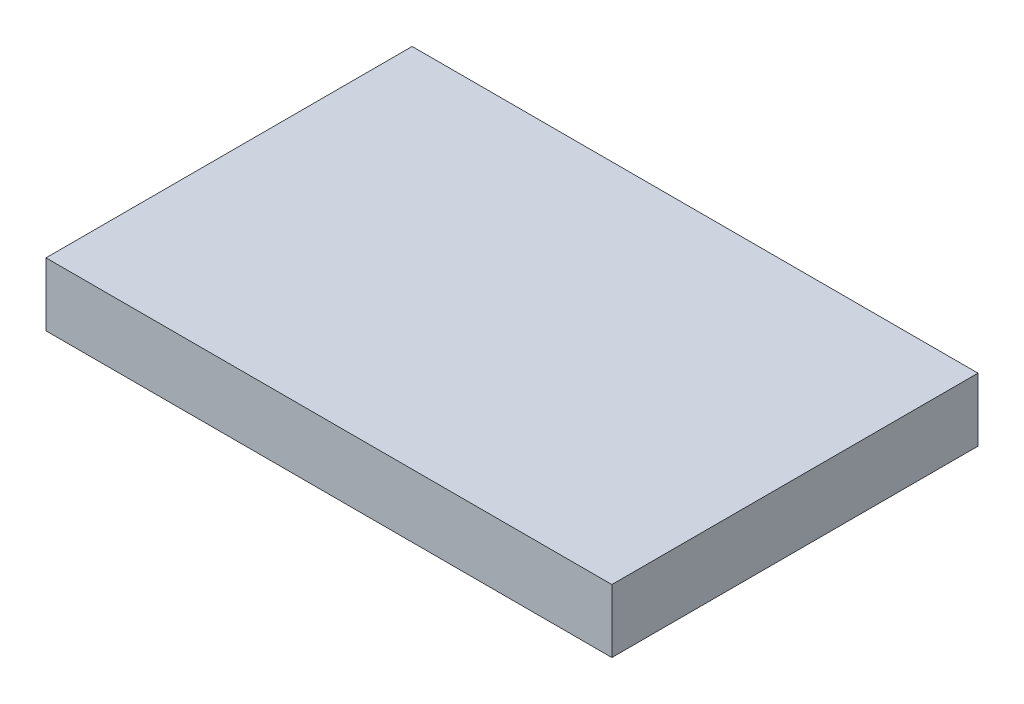
ISO-10303-21;
HEADER;
FILE_DESCRIPTION(('STEP AP214'),'2;1');
FILE_NAME('part.step','',(''),(''),'','','');
FILE_SCHEMA(('AUTOMOTIVE_DESIGN { 1 0 10303 214 1 1 1 1 }'));
ENDSEC;
DATA;
#1=APPLICATION_CONTEXT('core data for automotive mechanical design processes');
#2=APPLICATION_PROTOCOL_DEFINITION('international standard','automotive_design',2000,#1);
#3=PRODUCT_CONTEXT('',#1,'mechanical');
#4=PRODUCT('Part','Part','',(#3));
#5=PRODUCT_RELATED_PRODUCT_CATEGORY('part','',(#4));
#6=PRODUCT_DEFINITION_FORMATION('','',#4);
#7=PRODUCT_DEFINITION_CONTEXT('part definition',#1,'design');
#8=PRODUCT_DEFINITION('design','',#6,#7);
#9=PRODUCT_DEFINITION_SHAPE('','',#8);
#10=(LENGTH_UNIT() NAMED_UNIT(*) SI_UNIT(.MILLI.,.METRE.));
#11=(NAMED_UNIT(*) PLANE_ANGLE_UNIT() SI_UNIT($,.RADIAN.));
#12=(NAMED_UNIT(*) SI_UNIT($,.STERADIAN.) SOLID_ANGLE_UNIT());
#13=UNCERTAINTY_MEASURE_WITH_UNIT(LENGTH_MEASURE(1.E-05),#10,'distance_accuracy_value','');
#14=(GEOMETRIC_REPRESENTATION_CONTEXT(3) GLOBAL_UNCERTAINTY_ASSIGNED_CONTEXT((#13)) GLOBAL_UNIT_ASSIGNED_CONTEXT((#10,
#11,#12)) REPRESENTATION_CONTEXT('',''));
#15=CARTESIAN_POINT('',(0.,0.,0.));
#16=DIRECTION('',(0.,0.,1.));
#17=DIRECTION('',(1.,0.,0.));
#18=AXIS2_PLACEMENT_3D('',#15,#16,#17);
#19=CARTESIAN_POINT('',(0.,9.652,0.));
#20=DIRECTION('',(1.,0.,0.));
#21=DIRECTION('',(0.,0.,-1.));
#22=AXIS2_PLACEMENT_3D('',#19,#20,#21);
#23=PLANE('',#22);
#24=DIRECTION('',(0.,0.,1.));
#25=VECTOR('',#24,1.);
#26=CARTESIAN_POINT('',(0.,0.,0.));
#27=LINE('',#26,#25);
#28=CARTESIAN_POINT('',(0.,0.,-55.88));
#29=VERTEX_POINT('',#28);
#30=CARTESIAN_POINT('',(0.,0.,0.));
#31=VERTEX_POINT('',#30);
#32=EDGE_CURVE('E100',#29,#31,#27,.T.);
#33=ORIENTED_EDGE('',*,*,#32,.T.);
#34=DIRECTION('',(0.,-1.,0.));
#35=VECTOR('',#34,1.);
#36=CARTESIAN_POINT('',(0.,9.652,0.));
#37=LINE('',#36,#35);
#38=CARTESIAN_POINT('',(0.,9.652,0.));
#39=VERTEX_POINT('',#38);
#40=EDGE_CURVE('E11',#39,#31,#37,.T.);
#41=ORIENTED_EDGE('',*,*,#40,.F.);
#42=DIRECTION('',(0.,0.,1.));
#43=VECTOR('',#42,1.);
#44=CARTESIAN_POINT('',(0.,9.652,0.));
#45=LINE('',#44,#43);
#46=CARTESIAN_POINT('',(0.,9.652,-55.88));
#47=VERTEX_POINT('',#46);
#48=EDGE_CURVE('E88',#47,#39,#45,.T.);
#49=ORIENTED_EDGE('',*,*,#48,.F.);
#50=DIRECTION('',(0.,-1.,0.));
#51=VECTOR('',#50,1.);
#52=CARTESIAN_POINT('',(0.,9.652,-55.88));
#53=LINE('',#52,#51);
#54=EDGE_CURVE('E96',#47,#29,#53,.T.);
#55=ORIENTED_EDGE('',*,*,#54,.T.);
#56=EDGE_LOOP('',(#33,#41,#49,#55));
#57=FACE_BOUND('',#56,.T.);
#58=ADVANCED_FACE('F37',(#57),#23,.F.);
#59=CARTESIAN_POINT('',(0.,9.652,0.));
#60=DIRECTION('',(0.,0.,-1.));
#61=DIRECTION('',(-1.,0.,0.));
#62=AXIS2_PLACEMENT_3D('',#59,#60,#61);
#63=PLANE('',#62);
#64=DIRECTION('',(1.,0.,0.));
#65=VECTOR('',#64,1.);
#66=CARTESIAN_POINT('',(0.,0.,0.));
#67=LINE('',#66,#65);
#68=CARTESIAN_POINT('',(86.36,0.,0.));
#69=VERTEX_POINT('',#68);
#70=EDGE_CURVE('E92',#31,#69,#67,.T.);
#71=ORIENTED_EDGE('',*,*,#70,.T.);
#72=DIRECTION('',(0.,-1.,0.));
#73=VECTOR('',#72,1.);
#74=CARTESIAN_POINT('',(86.36,9.652,0.));
#75=LINE('',#74,#73);
#76=CARTESIAN_POINT('',(86.36,9.652,0.));
#77=VERTEX_POINT('',#76);
#78=EDGE_CURVE('E45',#77,#69,#75,.T.);
#79=ORIENTED_EDGE('',*,*,#78,.F.);
#80=DIRECTION('',(1.,0.,0.));
#81=VECTOR('',#80,1.);
#82=CARTESIAN_POINT('',(0.,9.652,0.));
#83=LINE('',#82,#81);
#84=EDGE_CURVE('E83',#39,#77,#83,.T.);
#85=ORIENTED_EDGE('',*,*,#84,.F.);
#86=ORIENTED_EDGE('',*,*,#40,.T.);
#87=EDGE_LOOP('',(#71,#79,#85,#86));
#88=FACE_BOUND('',#87,.T.);
#89=ADVANCED_FACE('F91',(#88),#63,.F.);
#90=CARTESIAN_POINT('',(86.36,9.652,0.));
#91=DIRECTION('',(-1.,0.,0.));
#92=DIRECTION('',(0.,0.,1.));
#93=AXIS2_PLACEMENT_3D('',#90,#91,#92);
#94=PLANE('',#93);
#95=DIRECTION('',(0.,0.,-1.));
#96=VECTOR('',#95,1.);
#97=CARTESIAN_POINT('',(86.36,0.,0.));
#98=LINE('',#97,#96);
#99=CARTESIAN_POINT('',(86.36,0.,-55.88));
#100=VERTEX_POINT('',#99);
#101=EDGE_CURVE('E70',#69,#100,#98,.T.);
#102=ORIENTED_EDGE('',*,*,#101,.T.);
#103=DIRECTION('',(0.,-1.,0.));
#104=VECTOR('',#103,1.);
#105=CARTESIAN_POINT('',(86.36,9.652,-55.88));
#106=LINE('',#105,#104);
#107=CARTESIAN_POINT('',(86.36,9.652,-55.88));
#108=VERTEX_POINT('',#107);
#109=EDGE_CURVE('E93',#108,#100,#106,.T.);
#110=ORIENTED_EDGE('',*,*,#109,.F.);
#111=DIRECTION('',(0.,0.,-1.));
#112=VECTOR('',#111,1.);
#113=CARTESIAN_POINT('',(86.36,9.652,0.));
#114=LINE('',#113,#112);
#115=EDGE_CURVE('E86',#77,#108,#114,.T.);
#116=ORIENTED_EDGE('',*,*,#115,.F.);
#117=ORIENTED_EDGE('',*,*,#78,.T.);
#118=EDGE_LOOP('',(#102,#110,#116,#117));
#119=FACE_BOUND('',#118,.T.);
#120=ADVANCED_FACE('F94',(#119),#94,.F.);
#121=CARTESIAN_POINT('',(0.,9.652,-55.88));
#122=DIRECTION('',(0.,0.,1.));
#123=DIRECTION('',(1.,0.,0.));
#124=AXIS2_PLACEMENT_3D('',#121,#122,#123);
#125=PLANE('',#124);
#126=DIRECTION('',(-1.,0.,0.));
#127=VECTOR('',#126,1.);
#128=CARTESIAN_POINT('',(0.,0.,-55.88));
#129=LINE('',#128,#127);
#130=EDGE_CURVE('E76',#100,#29,#129,.T.);
#131=ORIENTED_EDGE('',*,*,#130,.T.);
#132=ORIENTED_EDGE('',*,*,#54,.F.);
#133=DIRECTION('',(-1.,0.,0.));
#134=VECTOR('',#133,1.);
#135=CARTESIAN_POINT('',(0.,9.652,-55.88));
#136=LINE('',#135,#134);
#137=EDGE_CURVE('E53',#108,#47,#136,.T.);
#138=ORIENTED_EDGE('',*,*,#137,.F.);
#139=ORIENTED_EDGE('',*,*,#109,.T.);
#140=EDGE_LOOP('',(#131,#132,#138,#139));
#141=FACE_BOUND('',#140,.T.);
#142=ADVANCED_FACE('F107',(#141),#125,.F.);
#143=CARTESIAN_POINT('',(0.,9.652,0.));
#144=DIRECTION('',(0.,-1.,0.));
#145=DIRECTION('',(0.,0.,-1.));
#146=AXIS2_PLACEMENT_3D('',#143,#144,#145);
#147=PLANE('',#146);
#148=ORIENTED_EDGE('',*,*,#48,.T.);
#149=ORIENTED_EDGE('',*,*,#84,.T.);
#150=ORIENTED_EDGE('',*,*,#115,.T.);
#151=ORIENTED_EDGE('',*,*,#137,.T.);
#152=EDGE_LOOP('',(#148,#149,#150,#151));
#153=FACE_BOUND('',#152,.T.);
#154=ADVANCED_FACE('F84',(#153),#147,.F.);
#155=CARTESIAN_POINT('',(0.,0.,0.));
#156=DIRECTION('',(0.,-1.,0.));
#157=DIRECTION('',(0.,0.,-1.));
#158=AXIS2_PLACEMENT_3D('',#155,#156,#157);
#159=PLANE('',#158);
#160=ORIENTED_EDGE('',*,*,#32,.F.);
#161=ORIENTED_EDGE('',*,*,#130,.F.);
#162=ORIENTED_EDGE('',*,*,#101,.F.);
#163=ORIENTED_EDGE('',*,*,#70,.F.);
#164=EDGE_LOOP('',(#160,#161,#162,#163));
#165=FACE_BOUND('',#164,.T.);
#166=ADVANCED_FACE('F110',(#165),#159,.T.);
#167=CLOSED_SHELL('',(#58,#89,#120,#142,#154,#166));
#168=MANIFOLD_SOLID_BREP('B2',#167);
#169=ADVANCED_BREP_SHAPE_REPRESENTATION('',(#18,#168),#14);
#170=SHAPE_DEFINITION_REPRESENTATION(#9,#169);
ENDSEC;
END-ISO-10303-21;
